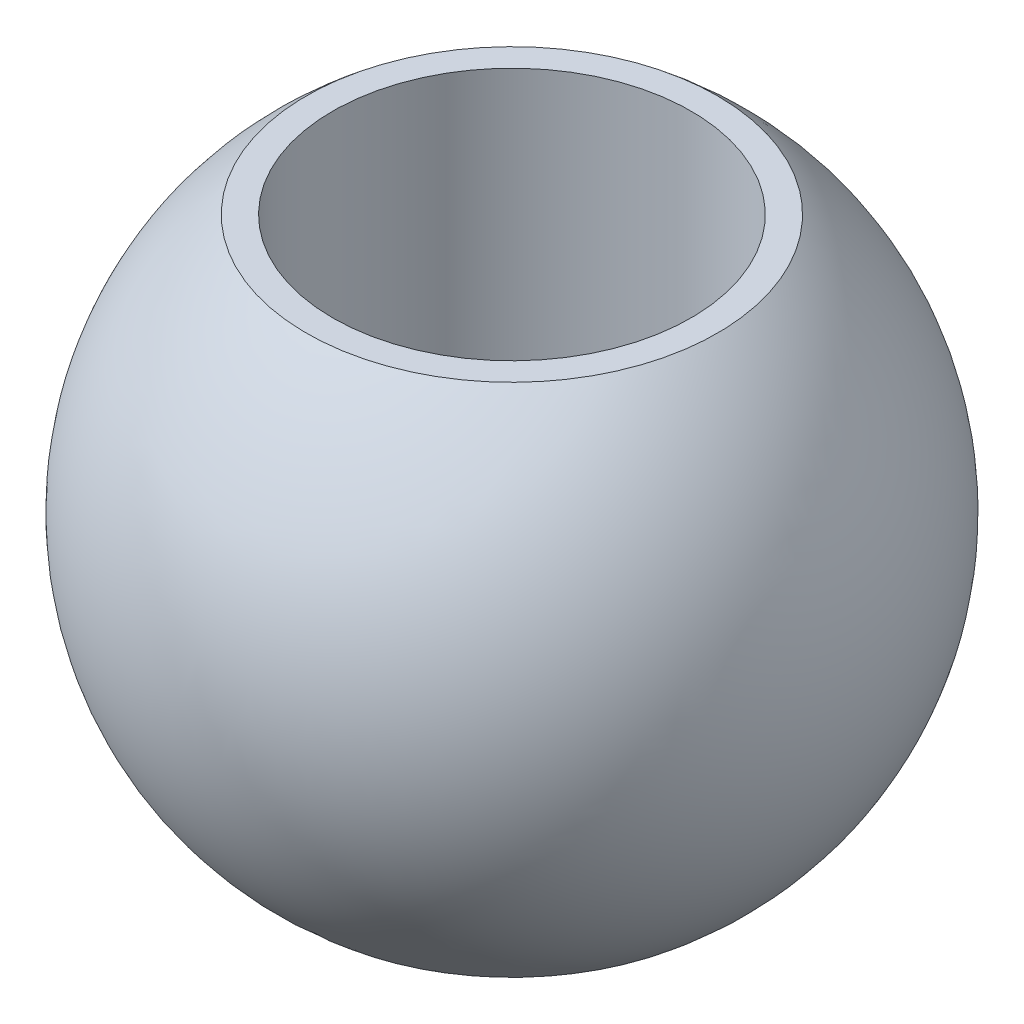
ISO-10303-21;
HEADER;
FILE_DESCRIPTION(('STEP AP214'),'2;1');
FILE_NAME('part.step','',(''),(''),'','','');
FILE_SCHEMA(('AUTOMOTIVE_DESIGN { 1 0 10303 214 1 1 1 1 }'));
ENDSEC;
DATA;
#1=APPLICATION_CONTEXT('core data for automotive mechanical design processes');
#2=APPLICATION_PROTOCOL_DEFINITION('international standard','automotive_design',2000,#1);
#3=PRODUCT_CONTEXT('',#1,'mechanical');
#4=PRODUCT('Part','Part','',(#3));
#5=PRODUCT_RELATED_PRODUCT_CATEGORY('part','',(#4));
#6=PRODUCT_DEFINITION_FORMATION('','',#4);
#7=PRODUCT_DEFINITION_CONTEXT('part definition',#1,'design');
#8=PRODUCT_DEFINITION('design','',#6,#7);
#9=PRODUCT_DEFINITION_SHAPE('','',#8);
#10=(LENGTH_UNIT() NAMED_UNIT(*) SI_UNIT(.MILLI.,.METRE.));
#11=(NAMED_UNIT(*) PLANE_ANGLE_UNIT() SI_UNIT($,.RADIAN.));
#12=(NAMED_UNIT(*) SI_UNIT($,.STERADIAN.) SOLID_ANGLE_UNIT());
#13=UNCERTAINTY_MEASURE_WITH_UNIT(LENGTH_MEASURE(1.E-05),#10,'distance_accuracy_value','');
#14=(GEOMETRIC_REPRESENTATION_CONTEXT(3) GLOBAL_UNCERTAINTY_ASSIGNED_CONTEXT((#13)) GLOBAL_UNIT_ASSIGNED_CONTEXT((#10,
#11,#12)) REPRESENTATION_CONTEXT('',''));
#15=CARTESIAN_POINT('',(0.,0.,0.));
#16=DIRECTION('',(0.,0.,1.));
#17=DIRECTION('',(1.,0.,0.));
#18=AXIS2_PLACEMENT_3D('',#15,#16,#17);
#19=CARTESIAN_POINT('',(-3.2004,-2.5019,0.));
#20=DIRECTION('',(0.,-1.,0.));
#21=DIRECTION('',(0.,0.,-1.));
#22=AXIS2_PLACEMENT_3D('',#19,#20,#21);
#23=PLANE('',#22);
#24=CARTESIAN_POINT('',(0.,-2.5019,-1.99575964234173));
#25=CARTESIAN_POINT('',(-0.0560346722170936,-2.50189999999999,-1.99575930632028));
#26=CARTESIAN_POINT('',(-0.112079642725923,-2.5019,-1.99339761447145));
#27=CARTESIAN_POINT('',(-0.22378227609302,-2.5019,-1.98396620752787));
#28=CARTESIAN_POINT('',(-0.279439819702583,-2.5019,-1.97689510247717));
#29=CARTESIAN_POINT('',(-0.390055072419233,-2.5019,-1.95807666254347));
#30=CARTESIAN_POINT('',(-0.445011527016511,-2.50190000000001,-1.94632190467887));
#31=CARTESIAN_POINT('',(-0.553769356559277,-2.50189999999999,-1.91821726004556));
#32=CARTESIAN_POINT('',(-0.607569755853978,-2.50189999999997,-1.9018636443001));
#33=CARTESIAN_POINT('',(-0.766430462652255,-2.50189999999995,-1.84613019713523));
#34=CARTESIAN_POINT('',(-0.869217626922962,-2.5019,-1.8000319891345));
#35=CARTESIAN_POINT('',(-1.06558091559531,-2.5019,-1.69121145697744));
#36=CARTESIAN_POINT('',(-1.15915668966074,-2.50189999999995,-1.6284885008679));
#37=CARTESIAN_POINT('',(-1.2905840924285,-2.50189999999996,-1.5233548847604));
#38=CARTESIAN_POINT('',(-1.3329286100139,-2.50189999999999,-1.4864410557549));
#39=CARTESIAN_POINT('',(-1.41432076495185,-2.50190000000001,-1.40921898523514));
#40=CARTESIAN_POINT('',(-1.45337154163061,-2.50190000000002,-1.3689140507604));
#41=CARTESIAN_POINT('',(-1.56524161330059,-2.50189999999997,-1.2432348025628));
#42=CARTESIAN_POINT('',(-1.63280707820095,-2.50189999999986,-1.15307325765921));
#43=CARTESIAN_POINT('',(-1.75180208237552,-2.50189999999986,-0.962735577955597));
#44=CARTESIAN_POINT('',(-1.80323223008811,-2.50189999999996,-0.862559820964231));
#45=CARTESIAN_POINT('',(-1.88855392098671,-2.50190000000004,-0.65498464787094));
#46=CARTESIAN_POINT('',(-1.9224456514912,-2.50190000000001,-0.547585308934088));
#47=CARTESIAN_POINT('',(-1.97171461997358,-2.50189999999999,-0.328623558957517));
#48=CARTESIAN_POINT('',(-1.9870917590757,-2.5019,-0.21706112568839));
#49=CARTESIAN_POINT('',(-1.99889952736295,-2.5019,0.00706192465384438));
#50=CARTESIAN_POINT('',(-1.99533015654808,-2.5019,0.119622541726951));
#51=CARTESIAN_POINT('',(-1.96934177259886,-2.5019,0.342549173397166));
#52=CARTESIAN_POINT('',(-1.94692286012871,-2.5019,0.452915199711058));
#53=CARTESIAN_POINT('',(-1.88388487135797,-2.5019,0.668306600175979));
#54=CARTESIAN_POINT('',(-1.84326560066759,-2.5019,0.773331917271973));
#55=CARTESIAN_POINT('',(-1.74492944747954,-2.5019,0.975119539066873));
#56=CARTESIAN_POINT('',(-1.68721192021277,-2.5019,1.0718815319815));
#57=CARTESIAN_POINT('',(-1.58916714483402,-2.5019,1.20861999907794));
#58=CARTESIAN_POINT('',(-1.55456766981818,-2.5019,1.25280514625271));
#59=CARTESIAN_POINT('',(-1.48174035509549,-2.5019,1.3381521631372));
#60=CARTESIAN_POINT('',(-1.44350904594776,-2.50189999999999,1.37931107398575));
#61=CARTESIAN_POINT('',(-1.32385633438595,-2.50190000000002,1.49767267269923));
#62=CARTESIAN_POINT('',(-1.23738932498913,-2.50190000000009,1.56988105864591));
#63=CARTESIAN_POINT('',(-1.05354761652184,-2.50189999999991,1.69873242877819));
#64=CARTESIAN_POINT('',(-0.956173332251882,-2.50189999999967,1.75537600460631));
#65=CARTESIAN_POINT('',(-0.804048365079136,-2.50189999999982,1.82749351745862));
#66=CARTESIAN_POINT('',(-0.752264188118166,-2.50189999999995,1.84940978376234));
#67=CARTESIAN_POINT('',(-0.647061582602095,-2.50190000000005,1.88878678630771));
#68=CARTESIAN_POINT('',(-0.593644516126227,-2.50190000000001,1.90625112836441));
#69=CARTESIAN_POINT('',(-0.485619003755023,-2.50189999999999,1.93658850616894));
#70=CARTESIAN_POINT('',(-0.431012585409021,-2.50190000000002,1.94946879198536));
#71=CARTESIAN_POINT('',(-0.320919351091252,-2.50189999999998,1.97058536120344));
#72=CARTESIAN_POINT('',(-0.265432799760391,-2.50189999999991,1.9788230143361));
#73=CARTESIAN_POINT('',(-0.174883540920641,-2.50189999999994,1.98839117005737));
#74=CARTESIAN_POINT('',(-0.139965808979363,-2.50189999999998,1.99115347264932));
#75=CARTESIAN_POINT('',(-0.0700333920552341,-2.50190000000002,1.99483781378933));
#76=CARTESIAN_POINT('',(-0.0350187070723832,-2.50190000000001,1.99575985233737));
#77=CARTESIAN_POINT('',(0.0560346722170939,-2.50189999999999,1.99575930632028));
#78=CARTESIAN_POINT('',(0.112079642725923,-2.5019,1.99339761447145));
#79=CARTESIAN_POINT('',(0.22378227609302,-2.5019,1.98396620752787));
#80=CARTESIAN_POINT('',(0.279439819702584,-2.5019,1.97689510247717));
#81=CARTESIAN_POINT('',(0.390055072419233,-2.5019,1.95807666254347));
#82=CARTESIAN_POINT('',(0.445011527016511,-2.50190000000001,1.94632190467887));
#83=CARTESIAN_POINT('',(0.553769356559277,-2.50189999999999,1.91821726004556));
#84=CARTESIAN_POINT('',(0.607569755853978,-2.50189999999997,1.9018636443001));
#85=CARTESIAN_POINT('',(0.766430462652255,-2.50189999999995,1.84613019713523));
#86=CARTESIAN_POINT('',(0.869217626922962,-2.5019,1.8000319891345));
#87=CARTESIAN_POINT('',(1.06558091559531,-2.5019,1.69121145697744));
#88=CARTESIAN_POINT('',(1.15915668966074,-2.50189999999995,1.6284885008679));
#89=CARTESIAN_POINT('',(1.2905840924285,-2.50189999999996,1.5233548847604));
#90=CARTESIAN_POINT('',(1.3329286100139,-2.50189999999999,1.4864410557549));
#91=CARTESIAN_POINT('',(1.41432076495185,-2.50190000000001,1.40921898523514));
#92=CARTESIAN_POINT('',(1.45337154163061,-2.50190000000002,1.3689140507604));
#93=CARTESIAN_POINT('',(1.56524161330059,-2.50189999999997,1.2432348025628));
#94=CARTESIAN_POINT('',(1.63280707820095,-2.50189999999986,1.15307325765921));
#95=CARTESIAN_POINT('',(1.75180208237552,-2.50189999999986,0.962735577955598));
#96=CARTESIAN_POINT('',(1.80323223008811,-2.50189999999996,0.862559820964232));
#97=CARTESIAN_POINT('',(1.88855392098671,-2.50190000000004,0.654984647870941));
#98=CARTESIAN_POINT('',(1.9224456514912,-2.50190000000001,0.547585308934089));
#99=CARTESIAN_POINT('',(1.97171461997358,-2.50189999999999,0.328623558957519));
#100=CARTESIAN_POINT('',(1.9870917590757,-2.5019,0.217061125688391));
#101=CARTESIAN_POINT('',(1.99889952736295,-2.5019,-0.00706192465384326));
#102=CARTESIAN_POINT('',(1.99533015654808,-2.5019,-0.11962254172695));
#103=CARTESIAN_POINT('',(1.96934177259886,-2.5019,-0.342549173397165));
#104=CARTESIAN_POINT('',(1.94692286012871,-2.5019,-0.452915199711057));
#105=CARTESIAN_POINT('',(1.88388487135797,-2.5019,-0.668306600175978));
#106=CARTESIAN_POINT('',(1.84326560066759,-2.5019,-0.773331917271972));
#107=CARTESIAN_POINT('',(1.74492944747954,-2.5019,-0.975119539066873));
#108=CARTESIAN_POINT('',(1.68721192021277,-2.5019,-1.0718815319815));
#109=CARTESIAN_POINT('',(1.58916714483402,-2.5019,-1.20861999907794));
#110=CARTESIAN_POINT('',(1.55456766981818,-2.5019,-1.25280514625271));
#111=CARTESIAN_POINT('',(1.48174035509549,-2.5019,-1.3381521631372));
#112=CARTESIAN_POINT('',(1.44350904594776,-2.50189999999999,-1.37931107398575));
#113=CARTESIAN_POINT('',(1.32385633438595,-2.50190000000002,-1.49767267269923));
#114=CARTESIAN_POINT('',(1.23738932498913,-2.50190000000009,-1.56988105864591));
#115=CARTESIAN_POINT('',(1.05354761652184,-2.50189999999991,-1.69873242877819));
#116=CARTESIAN_POINT('',(0.956173332251883,-2.50189999999967,-1.75537600460631));
#117=CARTESIAN_POINT('',(0.804048365079137,-2.50189999999982,-1.82749351745862));
#118=CARTESIAN_POINT('',(0.752264188118167,-2.50189999999995,-1.84940978376234));
#119=CARTESIAN_POINT('',(0.647061582602096,-2.50190000000005,-1.88878678630771));
#120=CARTESIAN_POINT('',(0.593644516126228,-2.50190000000001,-1.90625112836441));
#121=CARTESIAN_POINT('',(0.485619003755024,-2.50189999999999,-1.93658850616894));
#122=CARTESIAN_POINT('',(0.431012585409022,-2.50190000000002,-1.94946879198536));
#123=CARTESIAN_POINT('',(0.320919351091253,-2.50189999999998,-1.97058536120344));
#124=CARTESIAN_POINT('',(0.265432799760391,-2.50189999999992,-1.9788230143361));
#125=CARTESIAN_POINT('',(0.174883540920641,-2.50189999999994,-1.98839117005736));
#126=CARTESIAN_POINT('',(0.139965808979363,-2.50189999999998,-1.99115347264932));
#127=CARTESIAN_POINT('',(0.0700333920552345,-2.50190000000002,-1.99483781378933));
#128=CARTESIAN_POINT('',(0.0350187070723836,-2.50190000000001,-1.99575985233737));
#129=CARTESIAN_POINT('',(0.,-2.5019,-1.99575964234173));
#130=B_SPLINE_CURVE_WITH_KNOTS('',3,(#24,#25,#26,#27,#28,#29,#30,#31,#32,#33,#34,#35,#36,#37,
#38,#39,#40,#41,#42,#43,#44,#45,#46,#47,#48,#49,#50,#51,#52,#53,#54,#55,#56,#57,#58,#59,#60,#61,
#62,#63,#64,#65,#66,#67,#68,#69,#70,#71,#72,#73,#74,#75,#76,#77,#78,#79,#80,#81,#82,#83,#84,#85,
#86,#87,#88,#89,#90,#91,#92,#93,#94,#95,#96,#97,#98,#99,#100,#101,#102,#103,#104,#105,#106,#107,
#108,#109,#110,#111,#112,#113,#114,#115,#116,#117,#118,#119,#120,#121,#122,#123,#124,#125,#126,
#127,#128,#129),.UNSPECIFIED.,.T.,.F.,(4,2,2,2,2,2,2,2,2,2,2,2,2,2,2,2,2,2,2,2,2,2,2,2,2,2,2,2,
2,2,2,2,2,2,2,2,2,2,2,2,2,2,2,2,2,2,2,2,2,2,2,2,4),(0.,0.168071778115861,0.336193183636522,
0.504582106399736,0.673107962714009,1.00935633249561,1.34561748585261,1.51396837639698,
1.68215695132662,2.01842619035013,2.35468274764538,2.69093571348954,3.02719047505928,
3.36344523662901,3.69969820247316,4.03595475976841,4.37222399879191,4.54041257372153,
4.70876346426589,5.04502461762282,5.38127298740425,5.54979884371857,5.71818776648186,
5.88630917200259,6.0543809501185,6.15941692395576,6.26445289779301,6.43252467590888,
6.60064608142954,6.76903500419275,6.93756086050702,7.27380923028862,7.61007038364563,
7.77842127418999,7.94660984911963,8.28287908814315,8.61913564543839,8.95538861128255,
9.29164337285229,9.62789813442202,9.96415110026617,10.3004076575614,10.6366768965849,
10.8048654715145,10.9732163620589,11.3094775154158,11.6457258851973,11.8142517415116,
11.9826406642749,12.1507620697956,12.3188338479115,12.4238698217488,12.528905795586),.UNSPECIFIED.);
#131=CARTESIAN_POINT('',(0.,-2.5019,-1.99575964234173));
#132=VERTEX_POINT('',#131);
#133=EDGE_CURVE('E41',#132,#132,#130,.T.);
#134=ORIENTED_EDGE('',*,*,#133,.F.);
#135=EDGE_LOOP('',(#134));
#136=FACE_BOUND('',#135,.T.);
#137=CARTESIAN_POINT('',(0.,-2.5019,0.));
#138=DIRECTION('',(0.,1.,0.));
#139=DIRECTION('',(0.,0.,1.));
#140=AXIS2_PLACEMENT_3D('',#137,#138,#139);
#141=CIRCLE('',#140,1.7399);
#142=CARTESIAN_POINT('',(0.,-2.5019,1.7399));
#143=VERTEX_POINT('',#142);
#144=EDGE_CURVE('E20',#143,#143,#141,.T.);
#145=ORIENTED_EDGE('',*,*,#144,.T.);
#146=EDGE_LOOP('',(#145));
#147=FACE_BOUND('',#146,.T.);
#148=ADVANCED_FACE('F16',(#136,#147),#23,.T.);
#149=CARTESIAN_POINT('',(0.,-3.2004,0.));
#150=DIRECTION('',(0.,1.,0.));
#151=DIRECTION('',(0.,0.,1.));
#152=AXIS2_PLACEMENT_3D('',#149,#150,#151);
#153=CYLINDRICAL_SURFACE('',#152,1.7399);
#154=ORIENTED_EDGE('',*,*,#144,.F.);
#155=EDGE_LOOP('',(#154));
#156=FACE_BOUND('',#155,.T.);
#157=CARTESIAN_POINT('',(0.,2.5019,0.));
#158=DIRECTION('',(0.,1.,0.));
#159=DIRECTION('',(0.,0.,1.));
#160=AXIS2_PLACEMENT_3D('',#157,#158,#159);
#161=CIRCLE('',#160,1.7399);
#162=CARTESIAN_POINT('',(0.,2.5019,1.7399));
#163=VERTEX_POINT('',#162);
#164=EDGE_CURVE('E26',#163,#163,#161,.T.);
#165=ORIENTED_EDGE('',*,*,#164,.T.);
#166=EDGE_LOOP('',(#165));
#167=FACE_BOUND('',#166,.T.);
#168=ADVANCED_FACE('F57',(#156,#167),#153,.F.);
#169=CARTESIAN_POINT('',(-3.2004,2.5019,0.));
#170=DIRECTION('',(0.,-1.,0.));
#171=DIRECTION('',(0.,0.,-1.));
#172=AXIS2_PLACEMENT_3D('',#169,#170,#171);
#173=PLANE('',#172);
#174=CARTESIAN_POINT('',(0.,2.5019,-1.99575964234173));
#175=CARTESIAN_POINT('',(0.0560346722170939,2.50189999999998,-1.99575930632028));
#176=CARTESIAN_POINT('',(0.112079642725923,2.5019,-1.99339761447145));
#177=CARTESIAN_POINT('',(0.22378227609302,2.5019,-1.98396620752787));
#178=CARTESIAN_POINT('',(0.279439819702584,2.5019,-1.97689510247717));
#179=CARTESIAN_POINT('',(0.390055072419233,2.5019,-1.95807666254347));
#180=CARTESIAN_POINT('',(0.445011527016511,2.50190000000002,-1.94632190467887));
#181=CARTESIAN_POINT('',(0.553769356559277,2.50189999999998,-1.91821726004556));
#182=CARTESIAN_POINT('',(0.607569755853977,2.50189999999994,-1.9018636443001));
#183=CARTESIAN_POINT('',(0.766430462652255,2.5018999999999,-1.84613019713522));
#184=CARTESIAN_POINT('',(0.869217626922962,2.5019,-1.8000319891345));
#185=CARTESIAN_POINT('',(1.06558091559531,2.5019,-1.69121145697744));
#186=CARTESIAN_POINT('',(1.15915668966074,2.50189999999989,-1.6284885008679));
#187=CARTESIAN_POINT('',(1.2905840924285,2.50189999999993,-1.5233548847604));
#188=CARTESIAN_POINT('',(1.3329286100139,2.50189999999997,-1.4864410557549));
#189=CARTESIAN_POINT('',(1.41432076495185,2.50190000000003,-1.40921898523514));
#190=CARTESIAN_POINT('',(1.45337154163061,2.50190000000003,-1.3689140507604));
#191=CARTESIAN_POINT('',(1.56524161330059,2.50189999999994,-1.2432348025628));
#192=CARTESIAN_POINT('',(1.63280707820095,2.50189999999972,-1.15307325765921));
#193=CARTESIAN_POINT('',(1.75180208237552,2.50189999999972,-0.962735577955599));
#194=CARTESIAN_POINT('',(1.80323223008811,2.50189999999992,-0.862559820964231));
#195=CARTESIAN_POINT('',(1.88855392098671,2.50190000000008,-0.65498464787094));
#196=CARTESIAN_POINT('',(1.9224456514912,2.50190000000002,-0.547585308934087));
#197=CARTESIAN_POINT('',(1.97171461997358,2.50189999999998,-0.328623558957517));
#198=CARTESIAN_POINT('',(1.9870917590757,2.50189999999999,-0.21706112568839));
#199=CARTESIAN_POINT('',(1.99889952736295,2.50190000000001,0.00706192465384421));
#200=CARTESIAN_POINT('',(1.99533015654808,2.5019,0.119622541726951));
#201=CARTESIAN_POINT('',(1.96934177259886,2.5019,0.342549173397165));
#202=CARTESIAN_POINT('',(1.94692286012871,2.5019,0.452915199711058));
#203=CARTESIAN_POINT('',(1.88388487135797,2.5019,0.668306600175979));
#204=CARTESIAN_POINT('',(1.84326560066759,2.5019,0.773331917271973));
#205=CARTESIAN_POINT('',(1.74492944747954,2.5019,0.975119539066874));
#206=CARTESIAN_POINT('',(1.68721192021277,2.5019,1.0718815319815));
#207=CARTESIAN_POINT('',(1.58916714483402,2.5019,1.20861999907794));
#208=CARTESIAN_POINT('',(1.55456766981818,2.5019,1.25280514625271));
#209=CARTESIAN_POINT('',(1.48174035509549,2.5019,1.3381521631372));
#210=CARTESIAN_POINT('',(1.44350904594776,2.50189999999999,1.37931107398575));
#211=CARTESIAN_POINT('',(1.32385633438595,2.50190000000003,1.49767267269923));
#212=CARTESIAN_POINT('',(1.23738932498913,2.50190000000017,1.56988105864591));
#213=CARTESIAN_POINT('',(1.05354761652184,2.50189999999983,1.69873242877819));
#214=CARTESIAN_POINT('',(0.956173332251882,2.50189999999934,1.75537600460632));
#215=CARTESIAN_POINT('',(0.804048365079135,2.50189999999963,1.82749351745862));
#216=CARTESIAN_POINT('',(0.752264188118165,2.5018999999999,1.84940978376234));
#217=CARTESIAN_POINT('',(0.647061582602094,2.5019000000001,1.88878678630771));
#218=CARTESIAN_POINT('',(0.593644516126226,2.50190000000001,1.90625112836441));
#219=CARTESIAN_POINT('',(0.485619003755022,2.50189999999999,1.93658850616894));
#220=CARTESIAN_POINT('',(0.431012585409021,2.50190000000004,1.94946879198536));
#221=CARTESIAN_POINT('',(0.320919351091251,2.50189999999996,1.97058536120344));
#222=CARTESIAN_POINT('',(0.26543279976039,2.50189999999983,1.9788230143361));
#223=CARTESIAN_POINT('',(0.17488354092064,2.50189999999988,1.98839117005736));
#224=CARTESIAN_POINT('',(0.139965808979363,2.50189999999997,1.99115347264932));
#225=CARTESIAN_POINT('',(0.0700333920552341,2.50190000000003,1.99483781378933));
#226=CARTESIAN_POINT('',(0.0350187070723834,2.50190000000001,1.99575985233737));
#227=CARTESIAN_POINT('',(-0.0560346722170936,2.50189999999998,1.99575930632027));
#228=CARTESIAN_POINT('',(-0.112079642725923,2.5019,1.99339761447145));
#229=CARTESIAN_POINT('',(-0.22378227609302,2.5019,1.98396620752787));
#230=CARTESIAN_POINT('',(-0.279439819702583,2.5019,1.97689510247717));
#231=CARTESIAN_POINT('',(-0.390055072419233,2.5019,1.95807666254347));
#232=CARTESIAN_POINT('',(-0.445011527016511,2.50190000000002,1.94632190467887));
#233=CARTESIAN_POINT('',(-0.553769356559277,2.50189999999998,1.91821726004556));
#234=CARTESIAN_POINT('',(-0.607569755853977,2.50189999999994,1.9018636443001));
#235=CARTESIAN_POINT('',(-0.766430462652255,2.5018999999999,1.84613019713523));
#236=CARTESIAN_POINT('',(-0.869217626922961,2.5019,1.8000319891345));
#237=CARTESIAN_POINT('',(-1.06558091559531,2.5019,1.69121145697744));
#238=CARTESIAN_POINT('',(-1.15915668966074,2.50189999999989,1.62848850086789));
#239=CARTESIAN_POINT('',(-1.2905840924285,2.50189999999993,1.5233548847604));
#240=CARTESIAN_POINT('',(-1.3329286100139,2.50189999999997,1.4864410557549));
#241=CARTESIAN_POINT('',(-1.41432076495185,2.50190000000003,1.40921898523514));
#242=CARTESIAN_POINT('',(-1.45337154163061,2.50190000000003,1.3689140507604));
#243=CARTESIAN_POINT('',(-1.56524161330059,2.50189999999994,1.2432348025628));
#244=CARTESIAN_POINT('',(-1.63280707820095,2.50189999999972,1.15307325765921));
#245=CARTESIAN_POINT('',(-1.75180208237552,2.50189999999972,0.962735577955598));
#246=CARTESIAN_POINT('',(-1.80323223008811,2.50189999999992,0.862559820964231));
#247=CARTESIAN_POINT('',(-1.88855392098671,2.50190000000008,0.654984647870942));
#248=CARTESIAN_POINT('',(-1.9224456514912,2.50190000000002,0.547585308934089));
#249=CARTESIAN_POINT('',(-1.97171461997358,2.50189999999998,0.328623558957519));
#250=CARTESIAN_POINT('',(-1.9870917590757,2.50189999999999,0.217061125688391));
#251=CARTESIAN_POINT('',(-1.99889952736295,2.50190000000001,-0.00706192465384245));
#252=CARTESIAN_POINT('',(-1.99533015654808,2.5019,-0.119622541726949));
#253=CARTESIAN_POINT('',(-1.96934177259886,2.5019,-0.342549173397164));
#254=CARTESIAN_POINT('',(-1.94692286012871,2.5019,-0.452915199711056));
#255=CARTESIAN_POINT('',(-1.88388487135797,2.5019,-0.668306600175977));
#256=CARTESIAN_POINT('',(-1.84326560066759,2.5019,-0.773331917271971));
#257=CARTESIAN_POINT('',(-1.74492944747954,2.5019,-0.975119539066872));
#258=CARTESIAN_POINT('',(-1.68721192021277,2.5019,-1.0718815319815));
#259=CARTESIAN_POINT('',(-1.58916714483402,2.5019,-1.20861999907794));
#260=CARTESIAN_POINT('',(-1.55456766981818,2.5019,-1.25280514625271));
#261=CARTESIAN_POINT('',(-1.48174035509549,2.5019,-1.33815216313719));
#262=CARTESIAN_POINT('',(-1.44350904594776,2.50189999999998,-1.37931107398574));
#263=CARTESIAN_POINT('',(-1.32385633438595,2.50190000000003,-1.49767267269923));
#264=CARTESIAN_POINT('',(-1.23738932498913,2.50190000000017,-1.56988105864591));
#265=CARTESIAN_POINT('',(-1.05354761652184,2.50189999999983,-1.69873242877819));
#266=CARTESIAN_POINT('',(-0.956173332251883,2.50189999999934,-1.75537600460631));
#267=CARTESIAN_POINT('',(-0.804048365079137,2.50189999999963,-1.82749351745862));
#268=CARTESIAN_POINT('',(-0.752264188118167,2.50189999999991,-1.84940978376234));
#269=CARTESIAN_POINT('',(-0.647061582602096,2.50190000000009,-1.88878678630771));
#270=CARTESIAN_POINT('',(-0.593644516126229,2.50190000000001,-1.90625112836441));
#271=CARTESIAN_POINT('',(-0.485619003755024,2.50189999999999,-1.93658850616894));
#272=CARTESIAN_POINT('',(-0.431012585409023,2.50190000000004,-1.94946879198536));
#273=CARTESIAN_POINT('',(-0.320919351091253,2.50189999999996,-1.97058536120344));
#274=CARTESIAN_POINT('',(-0.265432799760392,2.50189999999983,-1.9788230143361));
#275=CARTESIAN_POINT('',(-0.174883540920642,2.50189999999988,-1.98839117005737));
#276=CARTESIAN_POINT('',(-0.139965808979364,2.50189999999997,-1.99115347264932));
#277=CARTESIAN_POINT('',(-0.0700333920552346,2.50190000000003,-1.99483781378933));
#278=CARTESIAN_POINT('',(-0.0350187070723834,2.50190000000001,-1.99575985233738));
#279=CARTESIAN_POINT('',(0.,2.5019,-1.99575964234173));
#280=B_SPLINE_CURVE_WITH_KNOTS('',3,(#174,#175,#176,#177,#178,#179,#180,#181,#182,#183,#184,
#185,#186,#187,#188,#189,#190,#191,#192,#193,#194,#195,#196,#197,#198,#199,#200,#201,#202,#203,
#204,#205,#206,#207,#208,#209,#210,#211,#212,#213,#214,#215,#216,#217,#218,#219,#220,#221,#222,
#223,#224,#225,#226,#227,#228,#229,#230,#231,#232,#233,#234,#235,#236,#237,#238,#239,#240,#241,
#242,#243,#244,#245,#246,#247,#248,#249,#250,#251,#252,#253,#254,#255,#256,#257,#258,#259,#260,
#261,#262,#263,#264,#265,#266,#267,#268,#269,#270,#271,#272,#273,#274,#275,#276,#277,#278,#279),
.UNSPECIFIED.,.T.,.F.,(4,2,2,2,2,2,2,2,2,2,2,2,2,2,2,2,2,2,2,2,2,2,2,2,2,2,2,2,2,2,2,2,2,2,2,2,
2,2,2,2,2,2,2,2,2,2,2,2,2,2,2,2,4),(0.,0.168071778115861,0.336193183636522,0.504582106399736,
0.673107962714008,1.00935633249561,1.34561748585261,1.51396837639698,1.68215695132662,
2.01842619035013,2.35468274764538,2.69093571348954,3.02719047505928,3.36344523662901,
3.69969820247316,4.03595475976841,4.37222399879191,4.54041257372153,4.70876346426589,
5.04502461762282,5.38127298740425,5.54979884371857,5.71818776648186,5.88630917200259,
6.0543809501185,6.15941692395576,6.26445289779301,6.43252467590887,6.60064608142953,
6.76903500419275,6.93756086050702,7.27380923028862,7.61007038364563,7.77842127418999,
7.94660984911963,8.28287908814315,8.61913564543839,8.95538861128255,9.29164337285229,
9.62789813442202,9.96415110026617,10.3004076575614,10.6366768965849,10.8048654715145,
10.9732163620589,11.3094775154158,11.6457258851973,11.8142517415116,11.9826406642749,
12.1507620697956,12.3188338479115,12.4238698217488,12.528905795586),.UNSPECIFIED.);
#281=CARTESIAN_POINT('',(0.,2.5019,-1.99575964234173));
#282=VERTEX_POINT('',#281);
#283=EDGE_CURVE('E11',#282,#282,#280,.T.);
#284=ORIENTED_EDGE('',*,*,#283,.F.);
#285=EDGE_LOOP('',(#284));
#286=FACE_BOUND('',#285,.T.);
#287=ORIENTED_EDGE('',*,*,#164,.F.);
#288=EDGE_LOOP('',(#287));
#289=FACE_BOUND('',#288,.T.);
#290=ADVANCED_FACE('F34',(#286,#289),#173,.F.);
#291=CARTESIAN_POINT('',(0.,0.,0.));
#292=DIRECTION('',(1.,0.,0.));
#293=DIRECTION('',(0.,0.,1.));
#294=AXIS2_PLACEMENT_3D('',#291,#292,#293);
#295=SPHERICAL_SURFACE('',#294,3.2004);
#296=CARTESIAN_POINT('',(-3.2004,0.,0.));
#297=VERTEX_POINT('',#296);
#298=VERTEX_LOOP('',#297);
#299=FACE_BOUND('',#298,.T.);
#300=CARTESIAN_POINT('',(3.2004,0.,0.));
#301=VERTEX_POINT('',#300);
#302=VERTEX_LOOP('',#301);
#303=FACE_BOUND('',#302,.T.);
#304=ORIENTED_EDGE('',*,*,#283,.T.);
#305=EDGE_LOOP('',(#304));
#306=FACE_BOUND('',#305,.T.);
#307=ORIENTED_EDGE('',*,*,#133,.T.);
#308=EDGE_LOOP('',(#307));
#309=FACE_BOUND('',#308,.T.);
#310=ADVANCED_FACE('F32',(#299,#303,#306,#309),#295,.T.);
#311=CLOSED_SHELL('',(#148,#168,#290,#310));
#312=MANIFOLD_SOLID_BREP('B1',#311);
#313=ADVANCED_BREP_SHAPE_REPRESENTATION('',(#18,#312),#14);
#314=SHAPE_DEFINITION_REPRESENTATION(#9,#313);
ENDSEC;
END-ISO-10303-21;
